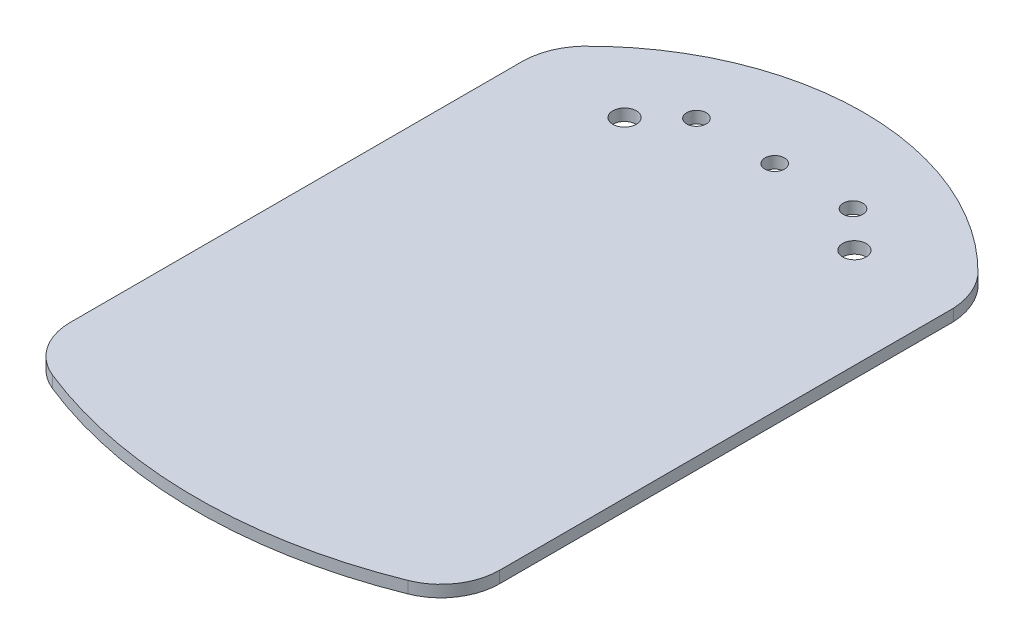
ISO-10303-21;
HEADER;
FILE_DESCRIPTION(('STEP AP214'),'2;1');
FILE_NAME('part.step','',(''),(''),'','','');
FILE_SCHEMA(('AUTOMOTIVE_DESIGN { 1 0 10303 214 1 1 1 1 }'));
ENDSEC;
DATA;
#1=APPLICATION_CONTEXT('core data for automotive mechanical design processes');
#2=APPLICATION_PROTOCOL_DEFINITION('international standard','automotive_design',2000,#1);
#3=PRODUCT_CONTEXT('',#1,'mechanical');
#4=PRODUCT('Part','Part','',(#3));
#5=PRODUCT_RELATED_PRODUCT_CATEGORY('part','',(#4));
#6=PRODUCT_DEFINITION_FORMATION('','',#4);
#7=PRODUCT_DEFINITION_CONTEXT('part definition',#1,'design');
#8=PRODUCT_DEFINITION('design','',#6,#7);
#9=PRODUCT_DEFINITION_SHAPE('','',#8);
#10=(LENGTH_UNIT() NAMED_UNIT(*) SI_UNIT(.MILLI.,.METRE.));
#11=(NAMED_UNIT(*) PLANE_ANGLE_UNIT() SI_UNIT($,.RADIAN.));
#12=(NAMED_UNIT(*) SI_UNIT($,.STERADIAN.) SOLID_ANGLE_UNIT());
#13=UNCERTAINTY_MEASURE_WITH_UNIT(LENGTH_MEASURE(1.E-05),#10,'distance_accuracy_value','');
#14=(GEOMETRIC_REPRESENTATION_CONTEXT(3) GLOBAL_UNCERTAINTY_ASSIGNED_CONTEXT((#13)) GLOBAL_UNIT_ASSIGNED_CONTEXT((#10,
#11,#12)) REPRESENTATION_CONTEXT('',''));
#15=CARTESIAN_POINT('',(0.,0.,0.));
#16=DIRECTION('',(0.,0.,1.));
#17=DIRECTION('',(1.,0.,0.));
#18=AXIS2_PLACEMENT_3D('',#15,#16,#17);
#19=CARTESIAN_POINT('',(37.3602624685065,3.,-32.07005319387));
#20=DIRECTION('',(0.,-1.,0.));
#21=DIRECTION('',(0.,0.,-1.));
#22=AXIS2_PLACEMENT_3D('',#19,#20,#21);
#23=PLANE('',#22);
#24=CARTESIAN_POINT('',(37.3602624685065,3.,-32.07005319387));
#25=DIRECTION('',(0.,1.,0.));
#26=DIRECTION('',(0.,0.,-1.));
#27=AXIS2_PLACEMENT_3D('',#24,#25,#26);
#28=CIRCLE('',#27,17.5128636739404);
#29=CARTESIAN_POINT('',(54.8439395783473,3.,-33.080710792096));
#30=VERTEX_POINT('',#29);
#31=CARTESIAN_POINT('',(50.58211493139,3.,-43.5540860879262));
#32=VERTEX_POINT('',#31);
#33=EDGE_CURVE('E164',#30,#32,#28,.T.);
#34=ORIENTED_EDGE('',*,*,#33,.T.);
#35=CARTESIAN_POINT('',(0.,3.,5.7806896552495));
#36=DIRECTION('',(0.,1.,0.));
#37=DIRECTION('',(0.,0.,-1.));
#38=AXIS2_PLACEMENT_3D('',#35,#36,#37);
#39=CIRCLE('',#38,70.6574160903283);
#40=CARTESIAN_POINT('',(-50.58211493139,3.,-43.5540860879262));
#41=VERTEX_POINT('',#40);
#42=EDGE_CURVE('E100',#32,#41,#39,.T.);
#43=ORIENTED_EDGE('',*,*,#42,.T.);
#44=CARTESIAN_POINT('',(-38.2098035596638,3.,-32.4157483550411));
#45=DIRECTION('',(0.,1.,0.));
#46=DIRECTION('',(0.,0.,-1.));
#47=AXIS2_PLACEMENT_3D('',#44,#45,#46);
#48=CIRCLE('',#47,16.6474219064321);
#49=CARTESIAN_POINT('',(-54.8439395783473,3.,-33.0807107920961));
#50=VERTEX_POINT('',#49);
#51=EDGE_CURVE('E185',#41,#50,#48,.T.);
#52=ORIENTED_EDGE('',*,*,#51,.T.);
#53=DIRECTION('',(0.,0.,1.));
#54=VECTOR('',#53,1.);
#55=CARTESIAN_POINT('',(-54.8439395783473,3.,82.9505924427365));
#56=LINE('',#55,#54);
#57=CARTESIAN_POINT('',(-54.8439395783473,3.,82.9505924427365));
#58=VERTEX_POINT('',#57);
#59=EDGE_CURVE('E199',#50,#58,#56,.T.);
#60=ORIENTED_EDGE('',*,*,#59,.T.);
#61=CARTESIAN_POINT('',(-39.8439395783473,3.,82.9505924427365));
#62=DIRECTION('',(0.,1.,0.));
#63=DIRECTION('',(0.,0.,-1.));
#64=AXIS2_PLACEMENT_3D('',#61,#62,#63);
#65=CIRCLE('',#64,15.);
#66=CARTESIAN_POINT('',(-45.4320236770883,3.,96.8708408638459));
#67=VERTEX_POINT('',#66);
#68=EDGE_CURVE('E119',#58,#67,#65,.T.);
#69=ORIENTED_EDGE('',*,*,#68,.T.);
#70=CARTESIAN_POINT('',(0.,3.,-16.3030206392909));
#71=DIRECTION('',(0.,1.,0.));
#72=DIRECTION('',(0.,0.,1.));
#73=AXIS2_PLACEMENT_3D('',#70,#71,#72);
#74=CIRCLE('',#73,121.95241573223);
#75=CARTESIAN_POINT('',(45.4320236770882,3.,96.8708408638459));
#76=VERTEX_POINT('',#75);
#77=EDGE_CURVE('E113',#67,#76,#74,.T.);
#78=ORIENTED_EDGE('',*,*,#77,.T.);
#79=CARTESIAN_POINT('',(39.8439395783473,3.,82.9505924427365));
#80=DIRECTION('',(0.,1.,0.));
#81=DIRECTION('',(0.,0.,-1.));
#82=AXIS2_PLACEMENT_3D('',#79,#80,#81);
#83=CIRCLE('',#82,15.);
#84=CARTESIAN_POINT('',(54.8439395783473,3.,82.9505924427365));
#85=VERTEX_POINT('',#84);
#86=EDGE_CURVE('E117',#76,#85,#83,.T.);
#87=ORIENTED_EDGE('',*,*,#86,.T.);
#88=DIRECTION('',(0.,0.,-1.));
#89=VECTOR('',#88,1.);
#90=CARTESIAN_POINT('',(54.8439395783473,3.,82.9505924427365));
#91=LINE('',#90,#89);
#92=EDGE_CURVE('E57',#85,#30,#91,.T.);
#93=ORIENTED_EDGE('',*,*,#92,.T.);
#94=EDGE_LOOP('',(#34,#43,#52,#60,#69,#78,#87,#93));
#95=FACE_BOUND('',#94,.T.);
#96=CARTESIAN_POINT('',(-29.3596264220961,3.,-33.1970249490394));
#97=DIRECTION('',(0.,1.,0.));
#98=DIRECTION('',(0.,0.,1.));
#99=AXIS2_PLACEMENT_3D('',#96,#97,#98);
#100=CIRCLE('',#99,3.);
#101=CARTESIAN_POINT('',(-29.3596264220961,3.,-30.1970249490394));
#102=VERTEX_POINT('',#101);
#103=EDGE_CURVE('E146',#102,#102,#100,.T.);
#104=ORIENTED_EDGE('',*,*,#103,.F.);
#105=EDGE_LOOP('',(#104));
#106=FACE_BOUND('',#105,.T.);
#107=CARTESIAN_POINT('',(29.3596264220961,3.,-33.1970249490393));
#108=DIRECTION('',(0.,1.,0.));
#109=DIRECTION('',(0.,0.,1.));
#110=AXIS2_PLACEMENT_3D('',#107,#108,#109);
#111=CIRCLE('',#110,3.);
#112=CARTESIAN_POINT('',(29.3596264220961,3.,-30.1970249490393));
#113=VERTEX_POINT('',#112);
#114=EDGE_CURVE('E213',#113,#113,#111,.T.);
#115=ORIENTED_EDGE('',*,*,#114,.F.);
#116=EDGE_LOOP('',(#115));
#117=FACE_BOUND('',#116,.T.);
#118=CARTESIAN_POINT('',(0.,3.,-42.2023677546132));
#119=DIRECTION('',(0.,1.,0.));
#120=DIRECTION('',(0.,0.,1.));
#121=AXIS2_PLACEMENT_3D('',#118,#119,#120);
#122=CIRCLE('',#121,2.5);
#123=CARTESIAN_POINT('',(0.,3.,-39.7023677546132));
#124=VERTEX_POINT('',#123);
#125=EDGE_CURVE('E221',#124,#124,#122,.T.);
#126=ORIENTED_EDGE('',*,*,#125,.F.);
#127=EDGE_LOOP('',(#126));
#128=FACE_BOUND('',#127,.T.);
#129=CARTESIAN_POINT('',(20.,3.,-42.2023677546132));
#130=DIRECTION('',(0.,1.,0.));
#131=DIRECTION('',(0.,0.,1.));
#132=AXIS2_PLACEMENT_3D('',#129,#130,#131);
#133=CIRCLE('',#132,2.5);
#134=CARTESIAN_POINT('',(20.,3.,-39.7023677546132));
#135=VERTEX_POINT('',#134);
#136=EDGE_CURVE('E229',#135,#135,#133,.T.);
#137=ORIENTED_EDGE('',*,*,#136,.F.);
#138=EDGE_LOOP('',(#137));
#139=FACE_BOUND('',#138,.T.);
#140=CARTESIAN_POINT('',(-20.,3.,-42.2023677546131));
#141=DIRECTION('',(0.,1.,0.));
#142=DIRECTION('',(0.,0.,1.));
#143=AXIS2_PLACEMENT_3D('',#140,#141,#142);
#144=CIRCLE('',#143,2.5);
#145=CARTESIAN_POINT('',(-20.,3.,-39.7023677546131));
#146=VERTEX_POINT('',#145);
#147=EDGE_CURVE('E237',#146,#146,#144,.T.);
#148=ORIENTED_EDGE('',*,*,#147,.F.);
#149=EDGE_LOOP('',(#148));
#150=FACE_BOUND('',#149,.T.);
#151=ADVANCED_FACE('F39',(#95,#106,#117,#128,#139,#150),#23,.F.);
#152=CARTESIAN_POINT('',(37.3602624685065,0.,-32.07005319387));
#153=DIRECTION('',(0.,-1.,0.));
#154=DIRECTION('',(0.,0.,-1.));
#155=AXIS2_PLACEMENT_3D('',#152,#153,#154);
#156=PLANE('',#155);
#157=CARTESIAN_POINT('',(20.,0.,-42.2023677546132));
#158=DIRECTION('',(0.,1.,0.));
#159=DIRECTION('',(0.,0.,1.));
#160=AXIS2_PLACEMENT_3D('',#157,#158,#159);
#161=CIRCLE('',#160,2.5);
#162=CARTESIAN_POINT('',(20.,0.,-39.7023677546132));
#163=VERTEX_POINT('',#162);
#164=EDGE_CURVE('E233',#163,#163,#161,.T.);
#165=ORIENTED_EDGE('',*,*,#164,.T.);
#166=EDGE_LOOP('',(#165));
#167=FACE_BOUND('',#166,.T.);
#168=CARTESIAN_POINT('',(29.3596264220961,0.,-33.1970249490393));
#169=DIRECTION('',(0.,1.,0.));
#170=DIRECTION('',(0.,0.,1.));
#171=AXIS2_PLACEMENT_3D('',#168,#169,#170);
#172=CIRCLE('',#171,3.);
#173=CARTESIAN_POINT('',(29.3596264220961,0.,-30.1970249490393));
#174=VERTEX_POINT('',#173);
#175=EDGE_CURVE('E217',#174,#174,#172,.T.);
#176=ORIENTED_EDGE('',*,*,#175,.T.);
#177=EDGE_LOOP('',(#176));
#178=FACE_BOUND('',#177,.T.);
#179=CARTESIAN_POINT('',(37.3602624685065,0.,-32.07005319387));
#180=DIRECTION('',(0.,1.,0.));
#181=DIRECTION('',(0.,0.,-1.));
#182=AXIS2_PLACEMENT_3D('',#179,#180,#181);
#183=CIRCLE('',#182,17.5128636739404);
#184=CARTESIAN_POINT('',(54.8439395783473,0.,-33.080710792096));
#185=VERTEX_POINT('',#184);
#186=CARTESIAN_POINT('',(50.58211493139,0.,-43.5540860879262));
#187=VERTEX_POINT('',#186);
#188=EDGE_CURVE('E141',#185,#187,#183,.T.);
#189=ORIENTED_EDGE('',*,*,#188,.F.);
#190=DIRECTION('',(0.,0.,-1.));
#191=VECTOR('',#190,1.);
#192=CARTESIAN_POINT('',(54.8439395783473,0.,82.9505924427365));
#193=LINE('',#192,#191);
#194=CARTESIAN_POINT('',(54.8439395783473,0.,82.9505924427365));
#195=VERTEX_POINT('',#194);
#196=EDGE_CURVE('E92',#195,#185,#193,.T.);
#197=ORIENTED_EDGE('',*,*,#196,.F.);
#198=CARTESIAN_POINT('',(39.8439395783473,0.,82.9505924427365));
#199=DIRECTION('',(0.,1.,0.));
#200=DIRECTION('',(0.,0.,-1.));
#201=AXIS2_PLACEMENT_3D('',#198,#199,#200);
#202=CIRCLE('',#201,15.);
#203=CARTESIAN_POINT('',(45.4320236770882,0.,96.8708408638459));
#204=VERTEX_POINT('',#203);
#205=EDGE_CURVE('E86',#204,#195,#202,.T.);
#206=ORIENTED_EDGE('',*,*,#205,.F.);
#207=CARTESIAN_POINT('',(0.,0.,-16.3030206392909));
#208=DIRECTION('',(0.,1.,0.));
#209=DIRECTION('',(0.,0.,1.));
#210=AXIS2_PLACEMENT_3D('',#207,#208,#209);
#211=CIRCLE('',#210,121.95241573223);
#212=CARTESIAN_POINT('',(-45.4320236770883,0.,96.8708408638459));
#213=VERTEX_POINT('',#212);
#214=EDGE_CURVE('E128',#213,#204,#211,.T.);
#215=ORIENTED_EDGE('',*,*,#214,.F.);
#216=CARTESIAN_POINT('',(-39.8439395783473,0.,82.9505924427365));
#217=DIRECTION('',(0.,1.,0.));
#218=DIRECTION('',(0.,0.,-1.));
#219=AXIS2_PLACEMENT_3D('',#216,#217,#218);
#220=CIRCLE('',#219,15.);
#221=CARTESIAN_POINT('',(-54.8439395783473,0.,82.9505924427365));
#222=VERTEX_POINT('',#221);
#223=EDGE_CURVE('E155',#222,#213,#220,.T.);
#224=ORIENTED_EDGE('',*,*,#223,.F.);
#225=DIRECTION('',(0.,0.,1.));
#226=VECTOR('',#225,1.);
#227=CARTESIAN_POINT('',(-54.8439395783473,0.,82.9505924427365));
#228=LINE('',#227,#226);
#229=CARTESIAN_POINT('',(-54.8439395783473,0.,-33.0807107920961));
#230=VERTEX_POINT('',#229);
#231=EDGE_CURVE('E152',#230,#222,#228,.T.);
#232=ORIENTED_EDGE('',*,*,#231,.F.);
#233=CARTESIAN_POINT('',(-38.2098035596638,0.,-32.4157483550411));
#234=DIRECTION('',(0.,1.,0.));
#235=DIRECTION('',(0.,0.,-1.));
#236=AXIS2_PLACEMENT_3D('',#233,#234,#235);
#237=CIRCLE('',#236,16.6474219064321);
#238=CARTESIAN_POINT('',(-50.58211493139,0.,-43.5540860879262));
#239=VERTEX_POINT('',#238);
#240=EDGE_CURVE('E149',#239,#230,#237,.T.);
#241=ORIENTED_EDGE('',*,*,#240,.F.);
#242=CARTESIAN_POINT('',(0.,0.,5.7806896552495));
#243=DIRECTION('',(0.,1.,0.));
#244=DIRECTION('',(0.,0.,-1.));
#245=AXIS2_PLACEMENT_3D('',#242,#243,#244);
#246=CIRCLE('',#245,70.6574160903283);
#247=EDGE_CURVE('E145',#187,#239,#246,.T.);
#248=ORIENTED_EDGE('',*,*,#247,.F.);
#249=EDGE_LOOP('',(#189,#197,#206,#215,#224,#232,#241,#248));
#250=FACE_BOUND('',#249,.T.);
#251=CARTESIAN_POINT('',(-29.3596264220961,0.,-33.1970249490394));
#252=DIRECTION('',(0.,1.,0.));
#253=DIRECTION('',(0.,0.,1.));
#254=AXIS2_PLACEMENT_3D('',#251,#252,#253);
#255=CIRCLE('',#254,3.);
#256=CARTESIAN_POINT('',(-29.3596264220961,0.,-30.1970249490394));
#257=VERTEX_POINT('',#256);
#258=EDGE_CURVE('E209',#257,#257,#255,.T.);
#259=ORIENTED_EDGE('',*,*,#258,.T.);
#260=EDGE_LOOP('',(#259));
#261=FACE_BOUND('',#260,.T.);
#262=CARTESIAN_POINT('',(0.,0.,-42.2023677546132));
#263=DIRECTION('',(0.,1.,0.));
#264=DIRECTION('',(0.,0.,1.));
#265=AXIS2_PLACEMENT_3D('',#262,#263,#264);
#266=CIRCLE('',#265,2.5);
#267=CARTESIAN_POINT('',(0.,0.,-39.7023677546132));
#268=VERTEX_POINT('',#267);
#269=EDGE_CURVE('E225',#268,#268,#266,.T.);
#270=ORIENTED_EDGE('',*,*,#269,.T.);
#271=EDGE_LOOP('',(#270));
#272=FACE_BOUND('',#271,.T.);
#273=CARTESIAN_POINT('',(-20.,0.,-42.2023677546131));
#274=DIRECTION('',(0.,1.,0.));
#275=DIRECTION('',(0.,0.,1.));
#276=AXIS2_PLACEMENT_3D('',#273,#274,#275);
#277=CIRCLE('',#276,2.5);
#278=CARTESIAN_POINT('',(-20.,0.,-39.7023677546131));
#279=VERTEX_POINT('',#278);
#280=EDGE_CURVE('E241',#279,#279,#277,.T.);
#281=ORIENTED_EDGE('',*,*,#280,.T.);
#282=EDGE_LOOP('',(#281));
#283=FACE_BOUND('',#282,.T.);
#284=ADVANCED_FACE('F189',(#167,#178,#250,#261,#272,#283),#156,.T.);
#285=CARTESIAN_POINT('',(37.3602624685065,3.,-32.07005319387));
#286=DIRECTION('',(0.,-1.,0.));
#287=DIRECTION('',(0.,0.,-1.));
#288=AXIS2_PLACEMENT_3D('',#285,#286,#287);
#289=CYLINDRICAL_SURFACE('',#288,17.5128636739404);
#290=ORIENTED_EDGE('',*,*,#188,.T.);
#291=DIRECTION('',(0.,-1.,0.));
#292=VECTOR('',#291,1.);
#293=CARTESIAN_POINT('',(50.58211493139,3.,-43.5540860879262));
#294=LINE('',#293,#292);
#295=EDGE_CURVE('E11',#32,#187,#294,.T.);
#296=ORIENTED_EDGE('',*,*,#295,.F.);
#297=ORIENTED_EDGE('',*,*,#33,.F.);
#298=DIRECTION('',(0.,-1.,0.));
#299=VECTOR('',#298,1.);
#300=CARTESIAN_POINT('',(54.8439395783473,3.,-33.080710792096));
#301=LINE('',#300,#299);
#302=EDGE_CURVE('E137',#30,#185,#301,.T.);
#303=ORIENTED_EDGE('',*,*,#302,.T.);
#304=EDGE_LOOP('',(#290,#296,#297,#303));
#305=FACE_BOUND('',#304,.T.);
#306=ADVANCED_FACE('F41',(#305),#289,.T.);
#307=CARTESIAN_POINT('',(0.,3.,5.7806896552495));
#308=DIRECTION('',(0.,-1.,0.));
#309=DIRECTION('',(0.,0.,-1.));
#310=AXIS2_PLACEMENT_3D('',#307,#308,#309);
#311=CYLINDRICAL_SURFACE('',#310,70.6574160903283);
#312=ORIENTED_EDGE('',*,*,#247,.T.);
#313=DIRECTION('',(0.,-1.,0.));
#314=VECTOR('',#313,1.);
#315=CARTESIAN_POINT('',(-50.58211493139,3.,-43.5540860879262));
#316=LINE('',#315,#314);
#317=EDGE_CURVE('E49',#41,#239,#316,.T.);
#318=ORIENTED_EDGE('',*,*,#317,.F.);
#319=ORIENTED_EDGE('',*,*,#42,.F.);
#320=ORIENTED_EDGE('',*,*,#295,.T.);
#321=EDGE_LOOP('',(#312,#318,#319,#320));
#322=FACE_BOUND('',#321,.T.);
#323=ADVANCED_FACE('F275',(#322),#311,.T.);
#324=CARTESIAN_POINT('',(-38.2098035596638,3.,-32.4157483550411));
#325=DIRECTION('',(0.,-1.,0.));
#326=DIRECTION('',(0.,0.,-1.));
#327=AXIS2_PLACEMENT_3D('',#324,#325,#326);
#328=CYLINDRICAL_SURFACE('',#327,16.6474219064321);
#329=ORIENTED_EDGE('',*,*,#240,.T.);
#330=DIRECTION('',(0.,-1.,0.));
#331=VECTOR('',#330,1.);
#332=CARTESIAN_POINT('',(-54.8439395783473,3.,-33.0807107920961));
#333=LINE('',#332,#331);
#334=EDGE_CURVE('E175',#50,#230,#333,.T.);
#335=ORIENTED_EDGE('',*,*,#334,.F.);
#336=ORIENTED_EDGE('',*,*,#51,.F.);
#337=ORIENTED_EDGE('',*,*,#317,.T.);
#338=EDGE_LOOP('',(#329,#335,#336,#337));
#339=FACE_BOUND('',#338,.T.);
#340=ADVANCED_FACE('F183',(#339),#328,.T.);
#341=CARTESIAN_POINT('',(-54.8439395783473,3.,82.9505924427365));
#342=DIRECTION('',(1.,0.,0.));
#343=DIRECTION('',(0.,0.,-1.));
#344=AXIS2_PLACEMENT_3D('',#341,#342,#343);
#345=PLANE('',#344);
#346=ORIENTED_EDGE('',*,*,#231,.T.);
#347=DIRECTION('',(0.,-1.,0.));
#348=VECTOR('',#347,1.);
#349=CARTESIAN_POINT('',(-54.8439395783473,3.,82.9505924427365));
#350=LINE('',#349,#348);
#351=EDGE_CURVE('E171',#58,#222,#350,.T.);
#352=ORIENTED_EDGE('',*,*,#351,.F.);
#353=ORIENTED_EDGE('',*,*,#59,.F.);
#354=ORIENTED_EDGE('',*,*,#334,.T.);
#355=EDGE_LOOP('',(#346,#352,#353,#354));
#356=FACE_BOUND('',#355,.T.);
#357=ADVANCED_FACE('F194',(#356),#345,.F.);
#358=CARTESIAN_POINT('',(-39.8439395783473,3.,82.9505924427365));
#359=DIRECTION('',(0.,-1.,0.));
#360=DIRECTION('',(0.,0.,-1.));
#361=AXIS2_PLACEMENT_3D('',#358,#359,#360);
#362=CYLINDRICAL_SURFACE('',#361,15.);
#363=ORIENTED_EDGE('',*,*,#223,.T.);
#364=DIRECTION('',(0.,-1.,0.));
#365=VECTOR('',#364,1.);
#366=CARTESIAN_POINT('',(-45.4320236770883,3.,96.8708408638459));
#367=LINE('',#366,#365);
#368=EDGE_CURVE('E130',#67,#213,#367,.T.);
#369=ORIENTED_EDGE('',*,*,#368,.F.);
#370=ORIENTED_EDGE('',*,*,#68,.F.);
#371=ORIENTED_EDGE('',*,*,#351,.T.);
#372=EDGE_LOOP('',(#363,#369,#370,#371));
#373=FACE_BOUND('',#372,.T.);
#374=ADVANCED_FACE('F197',(#373),#362,.T.);
#375=CARTESIAN_POINT('',(0.,3.,-16.3030206392909));
#376=DIRECTION('',(0.,-1.,0.));
#377=DIRECTION('',(0.,0.,-1.));
#378=AXIS2_PLACEMENT_3D('',#375,#376,#377);
#379=CYLINDRICAL_SURFACE('',#378,121.95241573223);
#380=ORIENTED_EDGE('',*,*,#214,.T.);
#381=DIRECTION('',(0.,-1.,0.));
#382=VECTOR('',#381,1.);
#383=CARTESIAN_POINT('',(45.4320236770882,3.,96.8708408638459));
#384=LINE('',#383,#382);
#385=EDGE_CURVE('E125',#76,#204,#384,.T.);
#386=ORIENTED_EDGE('',*,*,#385,.F.);
#387=ORIENTED_EDGE('',*,*,#77,.F.);
#388=ORIENTED_EDGE('',*,*,#368,.T.);
#389=EDGE_LOOP('',(#380,#386,#387,#388));
#390=FACE_BOUND('',#389,.T.);
#391=ADVANCED_FACE('F126',(#390),#379,.T.);
#392=CARTESIAN_POINT('',(39.8439395783473,3.,82.9505924427365));
#393=DIRECTION('',(0.,-1.,0.));
#394=DIRECTION('',(0.,0.,-1.));
#395=AXIS2_PLACEMENT_3D('',#392,#393,#394);
#396=CYLINDRICAL_SURFACE('',#395,15.);
#397=ORIENTED_EDGE('',*,*,#205,.T.);
#398=DIRECTION('',(0.,-1.,0.));
#399=VECTOR('',#398,1.);
#400=CARTESIAN_POINT('',(54.8439395783473,3.,82.9505924427365));
#401=LINE('',#400,#399);
#402=EDGE_CURVE('E131',#85,#195,#401,.T.);
#403=ORIENTED_EDGE('',*,*,#402,.F.);
#404=ORIENTED_EDGE('',*,*,#86,.F.);
#405=ORIENTED_EDGE('',*,*,#385,.T.);
#406=EDGE_LOOP('',(#397,#403,#404,#405));
#407=FACE_BOUND('',#406,.T.);
#408=ADVANCED_FACE('F133',(#407),#396,.T.);
#409=CARTESIAN_POINT('',(54.8439395783473,3.,82.9505924427365));
#410=DIRECTION('',(-1.,0.,0.));
#411=DIRECTION('',(0.,0.,1.));
#412=AXIS2_PLACEMENT_3D('',#409,#410,#411);
#413=PLANE('',#412);
#414=ORIENTED_EDGE('',*,*,#196,.T.);
#415=ORIENTED_EDGE('',*,*,#302,.F.);
#416=ORIENTED_EDGE('',*,*,#92,.F.);
#417=ORIENTED_EDGE('',*,*,#402,.T.);
#418=EDGE_LOOP('',(#414,#415,#416,#417));
#419=FACE_BOUND('',#418,.T.);
#420=ADVANCED_FACE('F263',(#419),#413,.F.);
#421=CARTESIAN_POINT('',(-29.3596264220961,3.,-33.1970249490394));
#422=DIRECTION('',(0.,-1.,0.));
#423=DIRECTION('',(0.,0.,-1.));
#424=AXIS2_PLACEMENT_3D('',#421,#422,#423);
#425=CYLINDRICAL_SURFACE('',#424,3.);
#426=ORIENTED_EDGE('',*,*,#103,.T.);
#427=EDGE_LOOP('',(#426));
#428=FACE_BOUND('',#427,.T.);
#429=ORIENTED_EDGE('',*,*,#258,.F.);
#430=EDGE_LOOP('',(#429));
#431=FACE_BOUND('',#430,.T.);
#432=ADVANCED_FACE('F260',(#428,#431),#425,.F.);
#433=CARTESIAN_POINT('',(29.3596264220961,3.,-33.1970249490393));
#434=DIRECTION('',(0.,-1.,0.));
#435=DIRECTION('',(0.,0.,-1.));
#436=AXIS2_PLACEMENT_3D('',#433,#434,#435);
#437=CYLINDRICAL_SURFACE('',#436,3.);
#438=ORIENTED_EDGE('',*,*,#114,.T.);
#439=EDGE_LOOP('',(#438));
#440=FACE_BOUND('',#439,.T.);
#441=ORIENTED_EDGE('',*,*,#175,.F.);
#442=EDGE_LOOP('',(#441));
#443=FACE_BOUND('',#442,.T.);
#444=ADVANCED_FACE('F339',(#440,#443),#437,.F.);
#445=CARTESIAN_POINT('',(0.,3.,-42.2023677546132));
#446=DIRECTION('',(0.,-1.,0.));
#447=DIRECTION('',(0.,0.,-1.));
#448=AXIS2_PLACEMENT_3D('',#445,#446,#447);
#449=CYLINDRICAL_SURFACE('',#448,2.5);
#450=ORIENTED_EDGE('',*,*,#125,.T.);
#451=EDGE_LOOP('',(#450));
#452=FACE_BOUND('',#451,.T.);
#453=ORIENTED_EDGE('',*,*,#269,.F.);
#454=EDGE_LOOP('',(#453));
#455=FACE_BOUND('',#454,.T.);
#456=ADVANCED_FACE('F347',(#452,#455),#449,.F.);
#457=CARTESIAN_POINT('',(20.,3.,-42.2023677546132));
#458=DIRECTION('',(0.,-1.,0.));
#459=DIRECTION('',(0.,0.,-1.));
#460=AXIS2_PLACEMENT_3D('',#457,#458,#459);
#461=CYLINDRICAL_SURFACE('',#460,2.5);
#462=ORIENTED_EDGE('',*,*,#136,.T.);
#463=EDGE_LOOP('',(#462));
#464=FACE_BOUND('',#463,.T.);
#465=ORIENTED_EDGE('',*,*,#164,.F.);
#466=EDGE_LOOP('',(#465));
#467=FACE_BOUND('',#466,.T.);
#468=ADVANCED_FACE('F355',(#464,#467),#461,.F.);
#469=CARTESIAN_POINT('',(-20.,3.,-42.2023677546131));
#470=DIRECTION('',(0.,-1.,0.));
#471=DIRECTION('',(0.,0.,-1.));
#472=AXIS2_PLACEMENT_3D('',#469,#470,#471);
#473=CYLINDRICAL_SURFACE('',#472,2.5);
#474=ORIENTED_EDGE('',*,*,#147,.T.);
#475=EDGE_LOOP('',(#474));
#476=FACE_BOUND('',#475,.T.);
#477=ORIENTED_EDGE('',*,*,#280,.F.);
#478=EDGE_LOOP('',(#477));
#479=FACE_BOUND('',#478,.T.);
#480=ADVANCED_FACE('F249',(#476,#479),#473,.F.);
#481=CLOSED_SHELL('',(#151,#284,#306,#323,#340,#357,#374,#391,#408,#420,#432,#444,#456,#468,#480));
#482=MANIFOLD_SOLID_BREP('B2',#481);
#483=ADVANCED_BREP_SHAPE_REPRESENTATION('',(#18,#482),#14);
#484=SHAPE_DEFINITION_REPRESENTATION(#9,#483);
ENDSEC;
END-ISO-10303-21;
